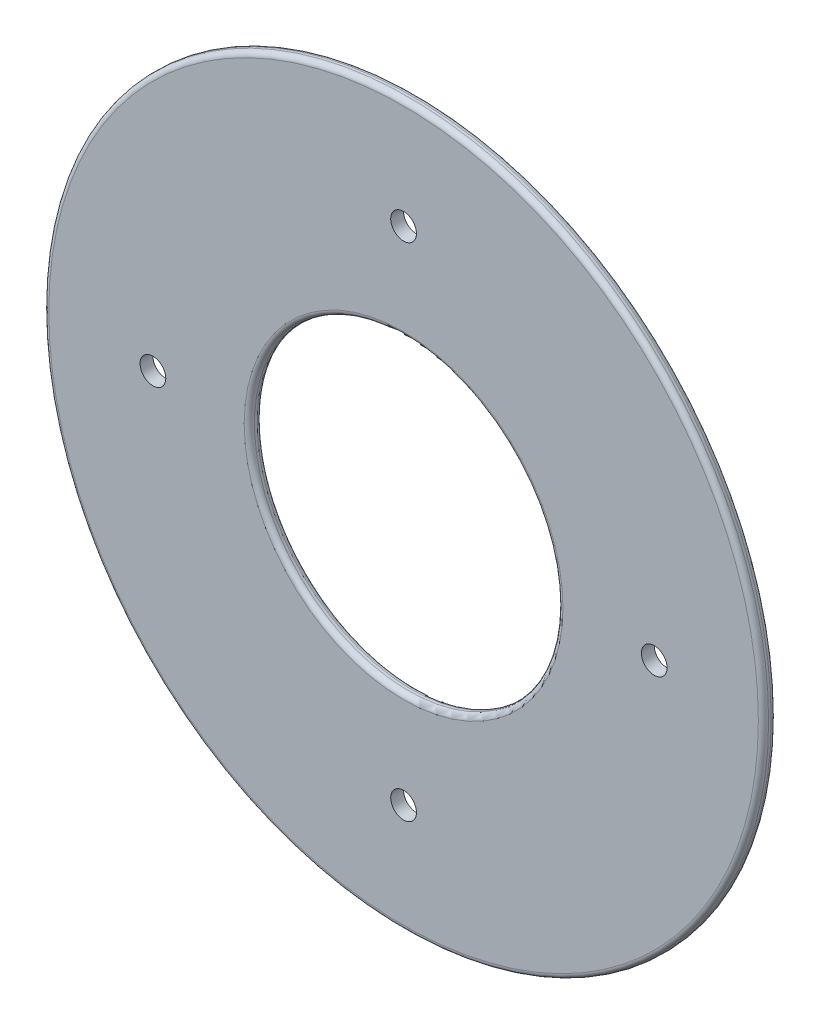
ISO-10303-21;
HEADER;
FILE_DESCRIPTION(('STEP AP214'),'2;1');
FILE_NAME('part.step','',(''),(''),'','','');
FILE_SCHEMA(('AUTOMOTIVE_DESIGN { 1 0 10303 214 1 1 1 1 }'));
ENDSEC;
DATA;
#1=APPLICATION_CONTEXT('core data for automotive mechanical design processes');
#2=APPLICATION_PROTOCOL_DEFINITION('international standard','automotive_design',2000,#1);
#3=PRODUCT_CONTEXT('',#1,'mechanical');
#4=PRODUCT('Part','Part','',(#3));
#5=PRODUCT_RELATED_PRODUCT_CATEGORY('part','',(#4));
#6=PRODUCT_DEFINITION_FORMATION('','',#4);
#7=PRODUCT_DEFINITION_CONTEXT('part definition',#1,'design');
#8=PRODUCT_DEFINITION('design','',#6,#7);
#9=PRODUCT_DEFINITION_SHAPE('','',#8);
#10=(LENGTH_UNIT() NAMED_UNIT(*) SI_UNIT(.MILLI.,.METRE.));
#11=(NAMED_UNIT(*) PLANE_ANGLE_UNIT() SI_UNIT($,.RADIAN.));
#12=(NAMED_UNIT(*) SI_UNIT($,.STERADIAN.) SOLID_ANGLE_UNIT());
#13=UNCERTAINTY_MEASURE_WITH_UNIT(LENGTH_MEASURE(1.E-05),#10,'distance_accuracy_value','');
#14=(GEOMETRIC_REPRESENTATION_CONTEXT(3) GLOBAL_UNCERTAINTY_ASSIGNED_CONTEXT((#13)) GLOBAL_UNIT_ASSIGNED_CONTEXT((#10,
#11,#12)) REPRESENTATION_CONTEXT('',''));
#15=CARTESIAN_POINT('',(0.,0.,0.));
#16=DIRECTION('',(0.,0.,1.));
#17=DIRECTION('',(1.,0.,0.));
#18=AXIS2_PLACEMENT_3D('',#15,#16,#17);
#19=CARTESIAN_POINT('',(0.,0.,3.175));
#20=DIRECTION('',(0.,0.,-1.));
#21=DIRECTION('',(-1.,0.,0.));
#22=AXIS2_PLACEMENT_3D('',#19,#20,#21);
#23=CYLINDRICAL_SURFACE('',#22,88.9);
#24=CARTESIAN_POINT('',(0.,0.,1.27));
#25=DIRECTION('',(0.,0.,1.));
#26=DIRECTION('',(1.,0.,0.));
#27=AXIS2_PLACEMENT_3D('',#24,#25,#26);
#28=CIRCLE('',#27,88.9);
#29=CARTESIAN_POINT('',(88.9,0.,1.27));
#30=VERTEX_POINT('',#29);
#31=EDGE_CURVE('E81',#30,#30,#28,.T.);
#32=ORIENTED_EDGE('',*,*,#31,.T.);
#33=EDGE_LOOP('',(#32));
#34=FACE_BOUND('',#33,.T.);
#35=CARTESIAN_POINT('',(0.,0.,1.905));
#36=DIRECTION('',(0.,0.,1.));
#37=DIRECTION('',(1.,0.,0.));
#38=AXIS2_PLACEMENT_3D('',#35,#36,#37);
#39=CIRCLE('',#38,88.9);
#40=CARTESIAN_POINT('',(88.9,0.,1.905));
#41=VERTEX_POINT('',#40);
#42=EDGE_CURVE('E65',#41,#41,#39,.F.);
#43=ORIENTED_EDGE('',*,*,#42,.T.);
#44=EDGE_LOOP('',(#43));
#45=FACE_BOUND('',#44,.T.);
#46=ADVANCED_FACE('F41',(#34,#45),#23,.T.);
#47=CARTESIAN_POINT('',(0.,0.,3.175));
#48=DIRECTION('',(0.,0.,1.));
#49=DIRECTION('',(1.,0.,0.));
#50=AXIS2_PLACEMENT_3D('',#47,#48,#49);
#51=PLANE('',#50);
#52=CARTESIAN_POINT('',(0.,0.,3.175));
#53=DIRECTION('',(0.,0.,1.));
#54=DIRECTION('',(1.,0.,0.));
#55=AXIS2_PLACEMENT_3D('',#52,#53,#54);
#56=CIRCLE('',#55,39.37);
#57=CARTESIAN_POINT('',(39.37,0.,3.175));
#58=VERTEX_POINT('',#57);
#59=EDGE_CURVE('E10',#58,#58,#56,.F.);
#60=ORIENTED_EDGE('',*,*,#59,.T.);
#61=EDGE_LOOP('',(#60));
#62=FACE_BOUND('',#61,.T.);
#63=CARTESIAN_POINT('',(0.,61.9125,3.175));
#64=DIRECTION('',(0.,0.,1.));
#65=DIRECTION('',(1.,0.,0.));
#66=AXIS2_PLACEMENT_3D('',#63,#64,#65);
#67=CIRCLE('',#66,3.175);
#68=CARTESIAN_POINT('',(3.175,61.9125,3.175));
#69=VERTEX_POINT('',#68);
#70=EDGE_CURVE('E75',#69,#69,#67,.T.);
#71=ORIENTED_EDGE('',*,*,#70,.F.);
#72=EDGE_LOOP('',(#71));
#73=FACE_BOUND('',#72,.T.);
#74=CARTESIAN_POINT('',(61.9125000000017,1.75207699061467E-12,3.175));
#75=DIRECTION('',(0.,0.,1.));
#76=DIRECTION('',(1.,0.,0.));
#77=AXIS2_PLACEMENT_3D('',#74,#75,#76);
#78=CIRCLE('',#77,3.17500000000137);
#79=CARTESIAN_POINT('',(65.0875000000031,1.75207699061467E-12,3.175));
#80=VERTEX_POINT('',#79);
#81=EDGE_CURVE('E86',#80,#80,#78,.T.);
#82=ORIENTED_EDGE('',*,*,#81,.F.);
#83=EDGE_LOOP('',(#82));
#84=FACE_BOUND('',#83,.T.);
#85=CARTESIAN_POINT('',(3.50415398122933E-12,-61.9125,3.175));
#86=DIRECTION('',(0.,0.,1.));
#87=DIRECTION('',(1.,0.,0.));
#88=AXIS2_PLACEMENT_3D('',#85,#86,#87);
#89=CIRCLE('',#88,3.17500000000376);
#90=CARTESIAN_POINT('',(3.17500000000727,-61.9125,3.175));
#91=VERTEX_POINT('',#90);
#92=EDGE_CURVE('E89',#91,#91,#89,.T.);
#93=ORIENTED_EDGE('',*,*,#92,.F.);
#94=EDGE_LOOP('',(#93));
#95=FACE_BOUND('',#94,.T.);
#96=CARTESIAN_POINT('',(-61.9124999999982,-1.75965908510989E-12,3.175));
#97=DIRECTION('',(0.,0.,1.));
#98=DIRECTION('',(1.,0.,0.));
#99=AXIS2_PLACEMENT_3D('',#96,#97,#98);
#100=CIRCLE('',#99,3.17500000000281);
#101=CARTESIAN_POINT('',(-58.7374999999954,-1.75965908510989E-12,3.175));
#102=VERTEX_POINT('',#101);
#103=EDGE_CURVE('E92',#102,#102,#100,.T.);
#104=ORIENTED_EDGE('',*,*,#103,.F.);
#105=EDGE_LOOP('',(#104));
#106=FACE_BOUND('',#105,.T.);
#107=CARTESIAN_POINT('',(0.,0.,3.175));
#108=DIRECTION('',(0.,0.,1.));
#109=DIRECTION('',(1.,0.,0.));
#110=AXIS2_PLACEMENT_3D('',#107,#108,#109);
#111=CIRCLE('',#110,87.63);
#112=CARTESIAN_POINT('',(87.63,0.,3.175));
#113=VERTEX_POINT('',#112);
#114=EDGE_CURVE('E61',#113,#113,#111,.T.);
#115=ORIENTED_EDGE('',*,*,#114,.T.);
#116=EDGE_LOOP('',(#115));
#117=FACE_BOUND('',#116,.T.);
#118=ADVANCED_FACE('F101',(#62,#73,#84,#95,#106,#117),#51,.T.);
#119=CARTESIAN_POINT('',(0.,0.,0.));
#120=DIRECTION('',(0.,0.,1.));
#121=DIRECTION('',(1.,0.,0.));
#122=AXIS2_PLACEMENT_3D('',#119,#120,#121);
#123=PLANE('',#122);
#124=CARTESIAN_POINT('',(0.,0.,0.));
#125=DIRECTION('',(0.,0.,1.));
#126=DIRECTION('',(1.,0.,0.));
#127=AXIS2_PLACEMENT_3D('',#124,#125,#126);
#128=CIRCLE('',#127,39.37);
#129=CARTESIAN_POINT('',(39.37,0.,0.));
#130=VERTEX_POINT('',#129);
#131=EDGE_CURVE('E56',#130,#130,#128,.T.);
#132=ORIENTED_EDGE('',*,*,#131,.T.);
#133=EDGE_LOOP('',(#132));
#134=FACE_BOUND('',#133,.T.);
#135=CARTESIAN_POINT('',(0.,61.9125,0.));
#136=DIRECTION('',(0.,0.,1.));
#137=DIRECTION('',(1.,0.,0.));
#138=AXIS2_PLACEMENT_3D('',#135,#136,#137);
#139=CIRCLE('',#138,3.175);
#140=CARTESIAN_POINT('',(3.175,61.9125,0.));
#141=VERTEX_POINT('',#140);
#142=EDGE_CURVE('E62',#141,#141,#139,.T.);
#143=ORIENTED_EDGE('',*,*,#142,.T.);
#144=EDGE_LOOP('',(#143));
#145=FACE_BOUND('',#144,.T.);
#146=CARTESIAN_POINT('',(61.9125000000017,1.75207699061467E-12,0.));
#147=DIRECTION('',(0.,0.,1.));
#148=DIRECTION('',(1.,0.,0.));
#149=AXIS2_PLACEMENT_3D('',#146,#147,#148);
#150=CIRCLE('',#149,3.17500000000137);
#151=CARTESIAN_POINT('',(65.0875000000031,1.75207699061467E-12,0.));
#152=VERTEX_POINT('',#151);
#153=EDGE_CURVE('E66',#152,#152,#150,.T.);
#154=ORIENTED_EDGE('',*,*,#153,.T.);
#155=EDGE_LOOP('',(#154));
#156=FACE_BOUND('',#155,.T.);
#157=CARTESIAN_POINT('',(3.50415398122933E-12,-61.9125,0.));
#158=DIRECTION('',(0.,0.,1.));
#159=DIRECTION('',(1.,0.,0.));
#160=AXIS2_PLACEMENT_3D('',#157,#158,#159);
#161=CIRCLE('',#160,3.17500000000376);
#162=CARTESIAN_POINT('',(3.17500000000727,-61.9125,0.));
#163=VERTEX_POINT('',#162);
#164=EDGE_CURVE('E69',#163,#163,#161,.T.);
#165=ORIENTED_EDGE('',*,*,#164,.T.);
#166=EDGE_LOOP('',(#165));
#167=FACE_BOUND('',#166,.T.);
#168=CARTESIAN_POINT('',(-61.9124999999982,-1.75965908510989E-12,0.));
#169=DIRECTION('',(0.,0.,1.));
#170=DIRECTION('',(1.,0.,0.));
#171=AXIS2_PLACEMENT_3D('',#168,#169,#170);
#172=CIRCLE('',#171,3.17500000000281);
#173=CARTESIAN_POINT('',(-58.7374999999954,-1.75965908510989E-12,0.));
#174=VERTEX_POINT('',#173);
#175=EDGE_CURVE('E72',#174,#174,#172,.T.);
#176=ORIENTED_EDGE('',*,*,#175,.T.);
#177=EDGE_LOOP('',(#176));
#178=FACE_BOUND('',#177,.T.);
#179=CARTESIAN_POINT('',(0.,0.,0.));
#180=DIRECTION('',(0.,0.,1.));
#181=DIRECTION('',(1.,0.,0.));
#182=AXIS2_PLACEMENT_3D('',#179,#180,#181);
#183=CIRCLE('',#182,87.63);
#184=CARTESIAN_POINT('',(87.63,0.,0.));
#185=VERTEX_POINT('',#184);
#186=EDGE_CURVE('E78',#185,#185,#183,.F.);
#187=ORIENTED_EDGE('',*,*,#186,.T.);
#188=EDGE_LOOP('',(#187));
#189=FACE_BOUND('',#188,.T.);
#190=ADVANCED_FACE('F104',(#134,#145,#156,#167,#178,#189),#123,.F.);
#191=CARTESIAN_POINT('',(0.,0.,1.27));
#192=DIRECTION('',(0.,0.,1.));
#193=DIRECTION('',(1.,0.,0.));
#194=AXIS2_PLACEMENT_3D('',#191,#192,#193);
#195=TOROIDAL_SURFACE('',#194,87.63,1.27);
#196=ORIENTED_EDGE('',*,*,#186,.F.);
#197=EDGE_LOOP('',(#196));
#198=FACE_BOUND('',#197,.T.);
#199=ORIENTED_EDGE('',*,*,#31,.F.);
#200=EDGE_LOOP('',(#199));
#201=FACE_BOUND('',#200,.T.);
#202=ADVANCED_FACE('F113',(#198,#201),#195,.T.);
#203=CARTESIAN_POINT('',(0.,0.,1.905));
#204=DIRECTION('',(0.,0.,1.));
#205=DIRECTION('',(1.,0.,0.));
#206=AXIS2_PLACEMENT_3D('',#203,#204,#205);
#207=TOROIDAL_SURFACE('',#206,87.63,1.27);
#208=ORIENTED_EDGE('',*,*,#42,.F.);
#209=EDGE_LOOP('',(#208));
#210=FACE_BOUND('',#209,.T.);
#211=ORIENTED_EDGE('',*,*,#114,.F.);
#212=EDGE_LOOP('',(#211));
#213=FACE_BOUND('',#212,.T.);
#214=ADVANCED_FACE('F110',(#210,#213),#207,.T.);
#215=CARTESIAN_POINT('',(0.,0.,-9.525));
#216=DIRECTION('',(0.,0.,1.));
#217=DIRECTION('',(1.,0.,0.));
#218=AXIS2_PLACEMENT_3D('',#215,#216,#217);
#219=CYLINDRICAL_SURFACE('',#218,38.1);
#220=CARTESIAN_POINT('',(0.,0.,1.27));
#221=DIRECTION('',(0.,0.,1.));
#222=DIRECTION('',(1.,0.,0.));
#223=AXIS2_PLACEMENT_3D('',#220,#221,#222);
#224=CIRCLE('',#223,38.1);
#225=CARTESIAN_POINT('',(38.1,0.,1.27));
#226=VERTEX_POINT('',#225);
#227=EDGE_CURVE('E48',#226,#226,#224,.F.);
#228=ORIENTED_EDGE('',*,*,#227,.T.);
#229=EDGE_LOOP('',(#228));
#230=FACE_BOUND('',#229,.T.);
#231=CARTESIAN_POINT('',(0.,0.,1.905));
#232=DIRECTION('',(0.,0.,1.));
#233=DIRECTION('',(1.,0.,0.));
#234=AXIS2_PLACEMENT_3D('',#231,#232,#233);
#235=CIRCLE('',#234,38.1);
#236=CARTESIAN_POINT('',(38.1,0.,1.905));
#237=VERTEX_POINT('',#236);
#238=EDGE_CURVE('E52',#237,#237,#235,.T.);
#239=ORIENTED_EDGE('',*,*,#238,.T.);
#240=EDGE_LOOP('',(#239));
#241=FACE_BOUND('',#240,.T.);
#242=ADVANCED_FACE('F112',(#230,#241),#219,.F.);
#243=CARTESIAN_POINT('',(-61.9124999999982,-1.75965908510989E-12,-9.525));
#244=DIRECTION('',(0.,0.,1.));
#245=DIRECTION('',(1.,0.,0.));
#246=AXIS2_PLACEMENT_3D('',#243,#244,#245);
#247=CYLINDRICAL_SURFACE('',#246,3.17500000000281);
#248=ORIENTED_EDGE('',*,*,#103,.T.);
#249=EDGE_LOOP('',(#248));
#250=FACE_BOUND('',#249,.T.);
#251=ORIENTED_EDGE('',*,*,#175,.F.);
#252=EDGE_LOOP('',(#251));
#253=FACE_BOUND('',#252,.T.);
#254=ADVANCED_FACE('F120',(#250,#253),#247,.F.);
#255=CARTESIAN_POINT('',(3.50415398122933E-12,-61.9125,-9.525));
#256=DIRECTION('',(0.,0.,1.));
#257=DIRECTION('',(1.,0.,0.));
#258=AXIS2_PLACEMENT_3D('',#255,#256,#257);
#259=CYLINDRICAL_SURFACE('',#258,3.17500000000376);
#260=ORIENTED_EDGE('',*,*,#92,.T.);
#261=EDGE_LOOP('',(#260));
#262=FACE_BOUND('',#261,.T.);
#263=ORIENTED_EDGE('',*,*,#164,.F.);
#264=EDGE_LOOP('',(#263));
#265=FACE_BOUND('',#264,.T.);
#266=ADVANCED_FACE('F98',(#262,#265),#259,.F.);
#267=CARTESIAN_POINT('',(61.9125000000017,1.75207699061467E-12,-9.525));
#268=DIRECTION('',(0.,0.,1.));
#269=DIRECTION('',(1.,0.,0.));
#270=AXIS2_PLACEMENT_3D('',#267,#268,#269);
#271=CYLINDRICAL_SURFACE('',#270,3.17500000000137);
#272=ORIENTED_EDGE('',*,*,#81,.T.);
#273=EDGE_LOOP('',(#272));
#274=FACE_BOUND('',#273,.T.);
#275=ORIENTED_EDGE('',*,*,#153,.F.);
#276=EDGE_LOOP('',(#275));
#277=FACE_BOUND('',#276,.T.);
#278=ADVANCED_FACE('F135',(#274,#277),#271,.F.);
#279=CARTESIAN_POINT('',(0.,61.9125,-9.525));
#280=DIRECTION('',(0.,0.,1.));
#281=DIRECTION('',(1.,0.,0.));
#282=AXIS2_PLACEMENT_3D('',#279,#280,#281);
#283=CYLINDRICAL_SURFACE('',#282,3.175);
#284=ORIENTED_EDGE('',*,*,#70,.T.);
#285=EDGE_LOOP('',(#284));
#286=FACE_BOUND('',#285,.T.);
#287=ORIENTED_EDGE('',*,*,#142,.F.);
#288=EDGE_LOOP('',(#287));
#289=FACE_BOUND('',#288,.T.);
#290=ADVANCED_FACE('F138',(#286,#289),#283,.F.);
#291=CARTESIAN_POINT('',(0.,0.,1.27));
#292=DIRECTION('',(0.,0.,1.));
#293=DIRECTION('',(1.,0.,0.));
#294=AXIS2_PLACEMENT_3D('',#291,#292,#293);
#295=TOROIDAL_SURFACE('',#294,39.37,1.27);
#296=ORIENTED_EDGE('',*,*,#227,.F.);
#297=EDGE_LOOP('',(#296));
#298=FACE_BOUND('',#297,.T.);
#299=ORIENTED_EDGE('',*,*,#131,.F.);
#300=EDGE_LOOP('',(#299));
#301=FACE_BOUND('',#300,.T.);
#302=ADVANCED_FACE('F142',(#298,#301),#295,.T.);
#303=CARTESIAN_POINT('',(0.,0.,1.905));
#304=DIRECTION('',(0.,0.,1.));
#305=DIRECTION('',(1.,0.,0.));
#306=AXIS2_PLACEMENT_3D('',#303,#304,#305);
#307=TOROIDAL_SURFACE('',#306,39.37,1.27);
#308=ORIENTED_EDGE('',*,*,#59,.F.);
#309=EDGE_LOOP('',(#308));
#310=FACE_BOUND('',#309,.T.);
#311=ORIENTED_EDGE('',*,*,#238,.F.);
#312=EDGE_LOOP('',(#311));
#313=FACE_BOUND('',#312,.T.);
#314=ADVANCED_FACE('F43',(#310,#313),#307,.T.);
#315=CLOSED_SHELL('',(#46,#118,#190,#202,#214,#242,#254,#266,#278,#290,#302,#314));
#316=MANIFOLD_SOLID_BREP('B2',#315);
#317=ADVANCED_BREP_SHAPE_REPRESENTATION('',(#18,#316),#14);
#318=SHAPE_DEFINITION_REPRESENTATION(#9,#317);
ENDSEC;
END-ISO-10303-21;
